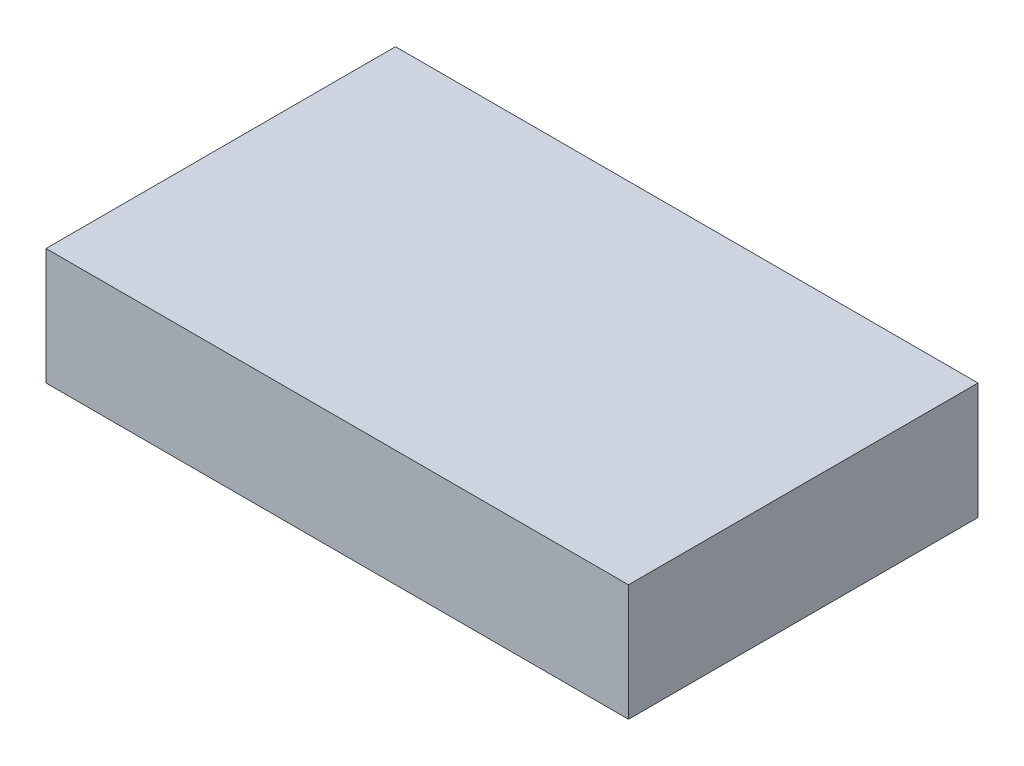
ISO-10303-21;
HEADER;
FILE_DESCRIPTION(('STEP AP214'),'2;1');
FILE_NAME('part.step','',(''),(''),'','','');
FILE_SCHEMA(('AUTOMOTIVE_DESIGN { 1 0 10303 214 1 1 1 1 }'));
ENDSEC;
DATA;
#1=APPLICATION_CONTEXT('core data for automotive mechanical design processes');
#2=APPLICATION_PROTOCOL_DEFINITION('international standard','automotive_design',2000,#1);
#3=PRODUCT_CONTEXT('',#1,'mechanical');
#4=PRODUCT('Part','Part','',(#3));
#5=PRODUCT_RELATED_PRODUCT_CATEGORY('part','',(#4));
#6=PRODUCT_DEFINITION_FORMATION('','',#4);
#7=PRODUCT_DEFINITION_CONTEXT('part definition',#1,'design');
#8=PRODUCT_DEFINITION('design','',#6,#7);
#9=PRODUCT_DEFINITION_SHAPE('','',#8);
#10=(LENGTH_UNIT() NAMED_UNIT(*) SI_UNIT(.MILLI.,.METRE.));
#11=(NAMED_UNIT(*) PLANE_ANGLE_UNIT() SI_UNIT($,.RADIAN.));
#12=(NAMED_UNIT(*) SI_UNIT($,.STERADIAN.) SOLID_ANGLE_UNIT());
#13=UNCERTAINTY_MEASURE_WITH_UNIT(LENGTH_MEASURE(1.E-05),#10,'distance_accuracy_value','');
#14=(GEOMETRIC_REPRESENTATION_CONTEXT(3) GLOBAL_UNCERTAINTY_ASSIGNED_CONTEXT((#13)) GLOBAL_UNIT_ASSIGNED_CONTEXT((#10,
#11,#12)) REPRESENTATION_CONTEXT('',''));
#15=CARTESIAN_POINT('',(0.,0.,0.));
#16=DIRECTION('',(0.,0.,1.));
#17=DIRECTION('',(1.,0.,0.));
#18=AXIS2_PLACEMENT_3D('',#15,#16,#17);
#19=CARTESIAN_POINT('',(-125.,50.,75.));
#20=DIRECTION('',(1.,0.,0.));
#21=DIRECTION('',(0.,0.,-1.));
#22=AXIS2_PLACEMENT_3D('',#19,#20,#21);
#23=PLANE('',#22);
#24=DIRECTION('',(0.,0.,1.));
#25=VECTOR('',#24,1.);
#26=CARTESIAN_POINT('',(-125.,0.,75.));
#27=LINE('',#26,#25);
#28=CARTESIAN_POINT('',(-125.,0.,-75.));
#29=VERTEX_POINT('',#28);
#30=CARTESIAN_POINT('',(-125.,0.,75.));
#31=VERTEX_POINT('',#30);
#32=EDGE_CURVE('E97',#29,#31,#27,.T.);
#33=ORIENTED_EDGE('',*,*,#32,.T.);
#34=DIRECTION('',(0.,-1.,0.));
#35=VECTOR('',#34,1.);
#36=CARTESIAN_POINT('',(-125.,50.,75.));
#37=LINE('',#36,#35);
#38=CARTESIAN_POINT('',(-125.,50.,75.));
#39=VERTEX_POINT('',#38);
#40=EDGE_CURVE('E11',#39,#31,#37,.T.);
#41=ORIENTED_EDGE('',*,*,#40,.F.);
#42=DIRECTION('',(0.,0.,1.));
#43=VECTOR('',#42,1.);
#44=CARTESIAN_POINT('',(-125.,50.,75.));
#45=LINE('',#44,#43);
#46=CARTESIAN_POINT('',(-125.,50.,-75.));
#47=VERTEX_POINT('',#46);
#48=EDGE_CURVE('E85',#47,#39,#45,.T.);
#49=ORIENTED_EDGE('',*,*,#48,.F.);
#50=DIRECTION('',(0.,-1.,0.));
#51=VECTOR('',#50,1.);
#52=CARTESIAN_POINT('',(-125.,50.,-75.));
#53=LINE('',#52,#51);
#54=EDGE_CURVE('E93',#47,#29,#53,.T.);
#55=ORIENTED_EDGE('',*,*,#54,.T.);
#56=EDGE_LOOP('',(#33,#41,#49,#55));
#57=FACE_BOUND('',#56,.T.);
#58=ADVANCED_FACE('F34',(#57),#23,.F.);
#59=CARTESIAN_POINT('',(-125.,50.,75.));
#60=DIRECTION('',(0.,0.,-1.));
#61=DIRECTION('',(-1.,0.,0.));
#62=AXIS2_PLACEMENT_3D('',#59,#60,#61);
#63=PLANE('',#62);
#64=DIRECTION('',(1.,0.,0.));
#65=VECTOR('',#64,1.);
#66=CARTESIAN_POINT('',(-125.,0.,75.));
#67=LINE('',#66,#65);
#68=CARTESIAN_POINT('',(125.,0.,75.));
#69=VERTEX_POINT('',#68);
#70=EDGE_CURVE('E89',#31,#69,#67,.T.);
#71=ORIENTED_EDGE('',*,*,#70,.T.);
#72=DIRECTION('',(0.,-1.,0.));
#73=VECTOR('',#72,1.);
#74=CARTESIAN_POINT('',(125.,50.,75.));
#75=LINE('',#74,#73);
#76=CARTESIAN_POINT('',(125.,50.,75.));
#77=VERTEX_POINT('',#76);
#78=EDGE_CURVE('E42',#77,#69,#75,.T.);
#79=ORIENTED_EDGE('',*,*,#78,.F.);
#80=DIRECTION('',(1.,0.,0.));
#81=VECTOR('',#80,1.);
#82=CARTESIAN_POINT('',(-125.,50.,75.));
#83=LINE('',#82,#81);
#84=EDGE_CURVE('E80',#39,#77,#83,.T.);
#85=ORIENTED_EDGE('',*,*,#84,.F.);
#86=ORIENTED_EDGE('',*,*,#40,.T.);
#87=EDGE_LOOP('',(#71,#79,#85,#86));
#88=FACE_BOUND('',#87,.T.);
#89=ADVANCED_FACE('F88',(#88),#63,.F.);
#90=CARTESIAN_POINT('',(125.,50.,75.));
#91=DIRECTION('',(-1.,0.,0.));
#92=DIRECTION('',(0.,0.,1.));
#93=AXIS2_PLACEMENT_3D('',#90,#91,#92);
#94=PLANE('',#93);
#95=DIRECTION('',(0.,0.,-1.));
#96=VECTOR('',#95,1.);
#97=CARTESIAN_POINT('',(125.,0.,75.));
#98=LINE('',#97,#96);
#99=CARTESIAN_POINT('',(125.,0.,-75.));
#100=VERTEX_POINT('',#99);
#101=EDGE_CURVE('E67',#69,#100,#98,.T.);
#102=ORIENTED_EDGE('',*,*,#101,.T.);
#103=DIRECTION('',(0.,-1.,0.));
#104=VECTOR('',#103,1.);
#105=CARTESIAN_POINT('',(125.,50.,-75.));
#106=LINE('',#105,#104);
#107=CARTESIAN_POINT('',(125.,50.,-75.));
#108=VERTEX_POINT('',#107);
#109=EDGE_CURVE('E90',#108,#100,#106,.T.);
#110=ORIENTED_EDGE('',*,*,#109,.F.);
#111=DIRECTION('',(0.,0.,-1.));
#112=VECTOR('',#111,1.);
#113=CARTESIAN_POINT('',(125.,50.,75.));
#114=LINE('',#113,#112);
#115=EDGE_CURVE('E83',#77,#108,#114,.T.);
#116=ORIENTED_EDGE('',*,*,#115,.F.);
#117=ORIENTED_EDGE('',*,*,#78,.T.);
#118=EDGE_LOOP('',(#102,#110,#116,#117));
#119=FACE_BOUND('',#118,.T.);
#120=ADVANCED_FACE('F91',(#119),#94,.F.);
#121=CARTESIAN_POINT('',(-125.,50.,-75.));
#122=DIRECTION('',(0.,0.,1.));
#123=DIRECTION('',(1.,0.,0.));
#124=AXIS2_PLACEMENT_3D('',#121,#122,#123);
#125=PLANE('',#124);
#126=DIRECTION('',(-1.,0.,0.));
#127=VECTOR('',#126,1.);
#128=CARTESIAN_POINT('',(-125.,0.,-75.));
#129=LINE('',#128,#127);
#130=EDGE_CURVE('E73',#100,#29,#129,.T.);
#131=ORIENTED_EDGE('',*,*,#130,.T.);
#132=ORIENTED_EDGE('',*,*,#54,.F.);
#133=DIRECTION('',(-1.,0.,0.));
#134=VECTOR('',#133,1.);
#135=CARTESIAN_POINT('',(-125.,50.,-75.));
#136=LINE('',#135,#134);
#137=EDGE_CURVE('E50',#108,#47,#136,.T.);
#138=ORIENTED_EDGE('',*,*,#137,.F.);
#139=ORIENTED_EDGE('',*,*,#109,.T.);
#140=EDGE_LOOP('',(#131,#132,#138,#139));
#141=FACE_BOUND('',#140,.T.);
#142=ADVANCED_FACE('F104',(#141),#125,.F.);
#143=CARTESIAN_POINT('',(0.,50.,0.));
#144=DIRECTION('',(0.,-1.,0.));
#145=DIRECTION('',(0.,0.,-1.));
#146=AXIS2_PLACEMENT_3D('',#143,#144,#145);
#147=PLANE('',#146);
#148=ORIENTED_EDGE('',*,*,#48,.T.);
#149=ORIENTED_EDGE('',*,*,#84,.T.);
#150=ORIENTED_EDGE('',*,*,#115,.T.);
#151=ORIENTED_EDGE('',*,*,#137,.T.);
#152=EDGE_LOOP('',(#148,#149,#150,#151));
#153=FACE_BOUND('',#152,.T.);
#154=ADVANCED_FACE('F81',(#153),#147,.F.);
#155=CARTESIAN_POINT('',(0.,0.,0.));
#156=DIRECTION('',(0.,-1.,0.));
#157=DIRECTION('',(0.,0.,-1.));
#158=AXIS2_PLACEMENT_3D('',#155,#156,#157);
#159=PLANE('',#158);
#160=ORIENTED_EDGE('',*,*,#32,.F.);
#161=ORIENTED_EDGE('',*,*,#130,.F.);
#162=ORIENTED_EDGE('',*,*,#101,.F.);
#163=ORIENTED_EDGE('',*,*,#70,.F.);
#164=EDGE_LOOP('',(#160,#161,#162,#163));
#165=FACE_BOUND('',#164,.T.);
#166=ADVANCED_FACE('F107',(#165),#159,.T.);
#167=CLOSED_SHELL('',(#58,#89,#120,#142,#154,#166));
#168=MANIFOLD_SOLID_BREP('B2',#167);
#169=ADVANCED_BREP_SHAPE_REPRESENTATION('',(#18,#168),#14);
#170=SHAPE_DEFINITION_REPRESENTATION(#9,#169);
ENDSEC;
END-ISO-10303-21;
